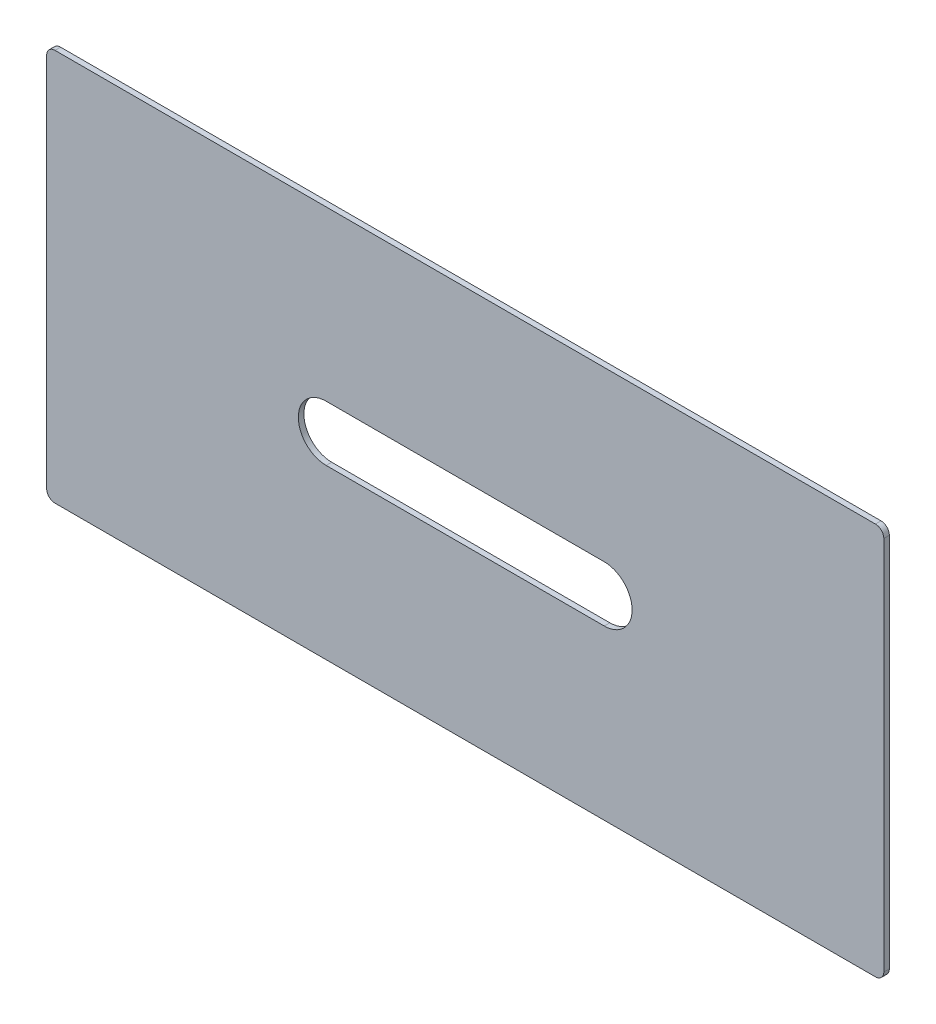
ISO-10303-21;
HEADER;
FILE_DESCRIPTION(('STEP AP214'),'2;1');
FILE_NAME('part.step','',(''),(''),'','','');
FILE_SCHEMA(('AUTOMOTIVE_DESIGN { 1 0 10303 214 1 1 1 1 }'));
ENDSEC;
DATA;
#1=APPLICATION_CONTEXT('core data for automotive mechanical design processes');
#2=APPLICATION_PROTOCOL_DEFINITION('international standard','automotive_design',2000,#1);
#3=PRODUCT_CONTEXT('',#1,'mechanical');
#4=PRODUCT('Part','Part','',(#3));
#5=PRODUCT_RELATED_PRODUCT_CATEGORY('part','',(#4));
#6=PRODUCT_DEFINITION_FORMATION('','',#4);
#7=PRODUCT_DEFINITION_CONTEXT('part definition',#1,'design');
#8=PRODUCT_DEFINITION('design','',#6,#7);
#9=PRODUCT_DEFINITION_SHAPE('','',#8);
#10=(LENGTH_UNIT() NAMED_UNIT(*) SI_UNIT(.MILLI.,.METRE.));
#11=(NAMED_UNIT(*) PLANE_ANGLE_UNIT() SI_UNIT($,.RADIAN.));
#12=(NAMED_UNIT(*) SI_UNIT($,.STERADIAN.) SOLID_ANGLE_UNIT());
#13=UNCERTAINTY_MEASURE_WITH_UNIT(LENGTH_MEASURE(1.E-05),#10,'distance_accuracy_value','');
#14=(GEOMETRIC_REPRESENTATION_CONTEXT(3) GLOBAL_UNCERTAINTY_ASSIGNED_CONTEXT((#13)) GLOBAL_UNIT_ASSIGNED_CONTEXT((#10,
#11,#12)) REPRESENTATION_CONTEXT('',''));
#15=CARTESIAN_POINT('',(0.,0.,0.));
#16=DIRECTION('',(0.,0.,1.));
#17=DIRECTION('',(1.,0.,0.));
#18=AXIS2_PLACEMENT_3D('',#15,#16,#17);
#19=CARTESIAN_POINT('',(-5.,-15.,-2.));
#20=DIRECTION('',(-1.,0.,0.));
#21=DIRECTION('',(0.,-1.,0.));
#22=AXIS2_PLACEMENT_3D('',#19,#20,#21);
#23=PLANE('',#22);
#24=DIRECTION('',(0.,-1.,0.));
#25=VECTOR('',#24,1.);
#26=CARTESIAN_POINT('',(-5.,-15.,-2.));
#27=LINE('',#26,#25);
#28=CARTESIAN_POINT('',(-5.,-18.,-2.));
#29=VERTEX_POINT('',#28);
#30=CARTESIAN_POINT('',(-4.99999999999999,-153.,-2.));
#31=VERTEX_POINT('',#30);
#32=EDGE_CURVE('E160',#29,#31,#27,.T.);
#33=ORIENTED_EDGE('',*,*,#32,.T.);
#34=DIRECTION('',(0.,0.,1.));
#35=VECTOR('',#34,1.);
#36=CARTESIAN_POINT('',(-4.99999999999999,-153.,-2.));
#37=LINE('',#36,#35);
#38=CARTESIAN_POINT('',(-4.99999999999999,-153.,0.));
#39=VERTEX_POINT('',#38);
#40=EDGE_CURVE('E185',#31,#39,#37,.T.);
#41=ORIENTED_EDGE('',*,*,#40,.T.);
#42=DIRECTION('',(0.,-1.,0.));
#43=VECTOR('',#42,1.);
#44=CARTESIAN_POINT('',(-5.,-15.,0.));
#45=LINE('',#44,#43);
#46=CARTESIAN_POINT('',(-5.,-18.,0.));
#47=VERTEX_POINT('',#46);
#48=EDGE_CURVE('E156',#47,#39,#45,.T.);
#49=ORIENTED_EDGE('',*,*,#48,.F.);
#50=DIRECTION('',(0.,0.,1.));
#51=VECTOR('',#50,1.);
#52=CARTESIAN_POINT('',(-5.,-18.,-2.));
#53=LINE('',#52,#51);
#54=EDGE_CURVE('E173',#47,#29,#53,.F.);
#55=ORIENTED_EDGE('',*,*,#54,.T.);
#56=EDGE_LOOP('',(#33,#41,#49,#55));
#57=FACE_BOUND('',#56,.T.);
#58=ADVANCED_FACE('F35',(#57),#23,.T.);
#59=CARTESIAN_POINT('',(-5.,-15.,-2.));
#60=DIRECTION('',(0.,1.,0.));
#61=DIRECTION('',(0.,0.,1.));
#62=AXIS2_PLACEMENT_3D('',#59,#60,#61);
#63=PLANE('',#62);
#64=DIRECTION('',(-1.,0.,0.));
#65=VECTOR('',#64,1.);
#66=CARTESIAN_POINT('',(-5.,-15.,0.));
#67=LINE('',#66,#65);
#68=CARTESIAN_POINT('',(293.,-15.,0.));
#69=VERTEX_POINT('',#68);
#70=CARTESIAN_POINT('',(-2.,-15.,0.));
#71=VERTEX_POINT('',#70);
#72=EDGE_CURVE('E164',#69,#71,#67,.T.);
#73=ORIENTED_EDGE('',*,*,#72,.F.);
#74=DIRECTION('',(0.,0.,1.));
#75=VECTOR('',#74,1.);
#76=CARTESIAN_POINT('',(293.,-15.,-2.));
#77=LINE('',#76,#75);
#78=CARTESIAN_POINT('',(293.,-15.,-2.));
#79=VERTEX_POINT('',#78);
#80=EDGE_CURVE('E11',#69,#79,#77,.F.);
#81=ORIENTED_EDGE('',*,*,#80,.T.);
#82=DIRECTION('',(-1.,0.,0.));
#83=VECTOR('',#82,1.);
#84=CARTESIAN_POINT('',(-5.,-15.,-2.));
#85=LINE('',#84,#83);
#86=CARTESIAN_POINT('',(-2.,-15.,-2.));
#87=VERTEX_POINT('',#86);
#88=EDGE_CURVE('E170',#79,#87,#85,.T.);
#89=ORIENTED_EDGE('',*,*,#88,.T.);
#90=DIRECTION('',(0.,0.,1.));
#91=VECTOR('',#90,1.);
#92=CARTESIAN_POINT('',(-2.,-15.,-2.));
#93=LINE('',#92,#91);
#94=EDGE_CURVE('E43',#87,#71,#93,.T.);
#95=ORIENTED_EDGE('',*,*,#94,.T.);
#96=EDGE_LOOP('',(#73,#81,#89,#95));
#97=FACE_BOUND('',#96,.T.);
#98=ADVANCED_FACE('F217',(#97),#63,.T.);
#99=CARTESIAN_POINT('',(296.,-15.,-2.));
#100=DIRECTION('',(1.,0.,0.));
#101=DIRECTION('',(0.,0.,-1.));
#102=AXIS2_PLACEMENT_3D('',#99,#100,#101);
#103=PLANE('',#102);
#104=DIRECTION('',(0.,1.,0.));
#105=VECTOR('',#104,1.);
#106=CARTESIAN_POINT('',(296.,-15.,0.));
#107=LINE('',#106,#105);
#108=CARTESIAN_POINT('',(296.,-153.,0.));
#109=VERTEX_POINT('',#108);
#110=CARTESIAN_POINT('',(296.,-18.,0.));
#111=VERTEX_POINT('',#110);
#112=EDGE_CURVE('E179',#109,#111,#107,.T.);
#113=ORIENTED_EDGE('',*,*,#112,.F.);
#114=DIRECTION('',(0.,0.,1.));
#115=VECTOR('',#114,1.);
#116=CARTESIAN_POINT('',(296.,-153.,-2.));
#117=LINE('',#116,#115);
#118=CARTESIAN_POINT('',(296.,-153.,-2.));
#119=VERTEX_POINT('',#118);
#120=EDGE_CURVE('E212',#109,#119,#117,.F.);
#121=ORIENTED_EDGE('',*,*,#120,.T.);
#122=DIRECTION('',(0.,1.,0.));
#123=VECTOR('',#122,1.);
#124=CARTESIAN_POINT('',(296.,-15.,-2.));
#125=LINE('',#124,#123);
#126=CARTESIAN_POINT('',(296.,-18.,-2.));
#127=VERTEX_POINT('',#126);
#128=EDGE_CURVE('E167',#119,#127,#125,.T.);
#129=ORIENTED_EDGE('',*,*,#128,.T.);
#130=DIRECTION('',(0.,0.,1.));
#131=VECTOR('',#130,1.);
#132=CARTESIAN_POINT('',(296.,-18.,-2.));
#133=LINE('',#132,#131);
#134=EDGE_CURVE('E209',#127,#111,#133,.T.);
#135=ORIENTED_EDGE('',*,*,#134,.T.);
#136=EDGE_LOOP('',(#113,#121,#129,#135));
#137=FACE_BOUND('',#136,.T.);
#138=ADVANCED_FACE('F231',(#137),#103,.T.);
#139=CARTESIAN_POINT('',(-4.99999999999999,-156.,-2.));
#140=DIRECTION('',(0.,-1.,0.));
#141=DIRECTION('',(0.,0.,-1.));
#142=AXIS2_PLACEMENT_3D('',#139,#140,#141);
#143=PLANE('',#142);
#144=DIRECTION('',(1.,0.,0.));
#145=VECTOR('',#144,1.);
#146=CARTESIAN_POINT('',(-4.99999999999999,-156.,0.));
#147=LINE('',#146,#145);
#148=CARTESIAN_POINT('',(-1.99999999999999,-156.,0.));
#149=VERTEX_POINT('',#148);
#150=CARTESIAN_POINT('',(293.,-156.,0.));
#151=VERTEX_POINT('',#150);
#152=EDGE_CURVE('E176',#149,#151,#147,.T.);
#153=ORIENTED_EDGE('',*,*,#152,.F.);
#154=DIRECTION('',(0.,0.,1.));
#155=VECTOR('',#154,1.);
#156=CARTESIAN_POINT('',(-1.99999999999999,-156.,-2.));
#157=LINE('',#156,#155);
#158=CARTESIAN_POINT('',(-1.99999999999999,-156.,-2.));
#159=VERTEX_POINT('',#158);
#160=EDGE_CURVE('E199',#149,#159,#157,.F.);
#161=ORIENTED_EDGE('',*,*,#160,.T.);
#162=DIRECTION('',(1.,0.,0.));
#163=VECTOR('',#162,1.);
#164=CARTESIAN_POINT('',(-4.99999999999999,-156.,-2.));
#165=LINE('',#164,#163);
#166=CARTESIAN_POINT('',(293.,-156.,-2.));
#167=VERTEX_POINT('',#166);
#168=EDGE_CURVE('E163',#159,#167,#165,.T.);
#169=ORIENTED_EDGE('',*,*,#168,.T.);
#170=DIRECTION('',(0.,0.,1.));
#171=VECTOR('',#170,1.);
#172=CARTESIAN_POINT('',(293.,-156.,-2.));
#173=LINE('',#172,#171);
#174=EDGE_CURVE('E196',#167,#151,#173,.T.);
#175=ORIENTED_EDGE('',*,*,#174,.T.);
#176=EDGE_LOOP('',(#153,#161,#169,#175));
#177=FACE_BOUND('',#176,.T.);
#178=ADVANCED_FACE('F241',(#177),#143,.T.);
#179=CARTESIAN_POINT('',(0.,0.,-2.));
#180=DIRECTION('',(0.,0.,1.));
#181=DIRECTION('',(1.,0.,0.));
#182=AXIS2_PLACEMENT_3D('',#179,#180,#181);
#183=PLANE('',#182);
#184=DIRECTION('',(-1.,0.,0.));
#185=VECTOR('',#184,1.);
#186=CARTESIAN_POINT('',(95.5,-75.5,-2.));
#187=LINE('',#186,#185);
#188=CARTESIAN_POINT('',(195.5,-75.5,-2.));
#189=VERTEX_POINT('',#188);
#190=CARTESIAN_POINT('',(95.5,-75.5,-2.));
#191=VERTEX_POINT('',#190);
#192=EDGE_CURVE('E131',#189,#191,#187,.T.);
#193=ORIENTED_EDGE('',*,*,#192,.T.);
#194=CARTESIAN_POINT('',(95.5,-85.5,-2.));
#195=DIRECTION('',(0.,0.,1.));
#196=DIRECTION('',(1.,0.,0.));
#197=AXIS2_PLACEMENT_3D('',#194,#195,#196);
#198=CIRCLE('',#197,9.99999999999999);
#199=CARTESIAN_POINT('',(95.5,-95.5,-2.));
#200=VERTEX_POINT('',#199);
#201=EDGE_CURVE('E125',#191,#200,#198,.T.);
#202=ORIENTED_EDGE('',*,*,#201,.T.);
#203=DIRECTION('',(1.,0.,0.));
#204=VECTOR('',#203,1.);
#205=CARTESIAN_POINT('',(95.5,-95.5,-2.));
#206=LINE('',#205,#204);
#207=CARTESIAN_POINT('',(195.5,-95.5,-2.));
#208=VERTEX_POINT('',#207);
#209=EDGE_CURVE('E134',#200,#208,#206,.T.);
#210=ORIENTED_EDGE('',*,*,#209,.T.);
#211=CARTESIAN_POINT('',(195.5,-85.5,-2.));
#212=DIRECTION('',(0.,0.,1.));
#213=DIRECTION('',(1.,0.,0.));
#214=AXIS2_PLACEMENT_3D('',#211,#212,#213);
#215=CIRCLE('',#214,9.99999999999998);
#216=EDGE_CURVE('E50',#208,#189,#215,.T.);
#217=ORIENTED_EDGE('',*,*,#216,.T.);
#218=EDGE_LOOP('',(#193,#202,#210,#217));
#219=FACE_BOUND('',#218,.T.);
#220=ORIENTED_EDGE('',*,*,#168,.F.);
#221=CARTESIAN_POINT('',(-1.99999999999999,-153.,-2.));
#222=DIRECTION('',(0.,0.,1.));
#223=DIRECTION('',(1.,0.,0.));
#224=AXIS2_PLACEMENT_3D('',#221,#222,#223);
#225=CIRCLE('',#224,3.);
#226=EDGE_CURVE('E207',#159,#31,#225,.F.);
#227=ORIENTED_EDGE('',*,*,#226,.T.);
#228=ORIENTED_EDGE('',*,*,#32,.F.);
#229=CARTESIAN_POINT('',(-2.,-18.,-2.));
#230=DIRECTION('',(0.,0.,1.));
#231=DIRECTION('',(1.,0.,0.));
#232=AXIS2_PLACEMENT_3D('',#229,#230,#231);
#233=CIRCLE('',#232,3.);
#234=EDGE_CURVE('E201',#29,#87,#233,.F.);
#235=ORIENTED_EDGE('',*,*,#234,.T.);
#236=ORIENTED_EDGE('',*,*,#88,.F.);
#237=CARTESIAN_POINT('',(293.,-18.,-2.));
#238=DIRECTION('',(0.,0.,1.));
#239=DIRECTION('',(1.,0.,0.));
#240=AXIS2_PLACEMENT_3D('',#237,#238,#239);
#241=CIRCLE('',#240,3.);
#242=EDGE_CURVE('E203',#79,#127,#241,.F.);
#243=ORIENTED_EDGE('',*,*,#242,.T.);
#244=ORIENTED_EDGE('',*,*,#128,.F.);
#245=CARTESIAN_POINT('',(293.,-153.,-2.));
#246=DIRECTION('',(0.,0.,1.));
#247=DIRECTION('',(1.,0.,0.));
#248=AXIS2_PLACEMENT_3D('',#245,#246,#247);
#249=CIRCLE('',#248,3.);
#250=EDGE_CURVE('E205',#119,#167,#249,.F.);
#251=ORIENTED_EDGE('',*,*,#250,.T.);
#252=EDGE_LOOP('',(#220,#227,#228,#235,#236,#243,#244,#251));
#253=FACE_BOUND('',#252,.T.);
#254=ADVANCED_FACE('F138',(#219,#253),#183,.F.);
#255=CARTESIAN_POINT('',(0.,0.,0.));
#256=DIRECTION('',(0.,0.,1.));
#257=DIRECTION('',(1.,0.,0.));
#258=AXIS2_PLACEMENT_3D('',#255,#256,#257);
#259=PLANE('',#258);
#260=CARTESIAN_POINT('',(95.5,-85.5,0.));
#261=DIRECTION('',(0.,0.,1.));
#262=DIRECTION('',(1.,0.,0.));
#263=AXIS2_PLACEMENT_3D('',#260,#261,#262);
#264=CIRCLE('',#263,9.99999999999999);
#265=CARTESIAN_POINT('',(95.5,-75.5,0.));
#266=VERTEX_POINT('',#265);
#267=CARTESIAN_POINT('',(95.5,-95.5,0.));
#268=VERTEX_POINT('',#267);
#269=EDGE_CURVE('E58',#266,#268,#264,.T.);
#270=ORIENTED_EDGE('',*,*,#269,.F.);
#271=DIRECTION('',(-1.,0.,0.));
#272=VECTOR('',#271,1.);
#273=CARTESIAN_POINT('',(95.5,-75.5,0.));
#274=LINE('',#273,#272);
#275=CARTESIAN_POINT('',(195.5,-75.5,0.));
#276=VERTEX_POINT('',#275);
#277=EDGE_CURVE('E141',#276,#266,#274,.T.);
#278=ORIENTED_EDGE('',*,*,#277,.F.);
#279=CARTESIAN_POINT('',(195.5,-85.5,0.));
#280=DIRECTION('',(0.,0.,1.));
#281=DIRECTION('',(1.,0.,0.));
#282=AXIS2_PLACEMENT_3D('',#279,#280,#281);
#283=CIRCLE('',#282,9.99999999999998);
#284=CARTESIAN_POINT('',(195.5,-95.5,0.));
#285=VERTEX_POINT('',#284);
#286=EDGE_CURVE('E144',#285,#276,#283,.T.);
#287=ORIENTED_EDGE('',*,*,#286,.F.);
#288=DIRECTION('',(1.,0.,0.));
#289=VECTOR('',#288,1.);
#290=CARTESIAN_POINT('',(95.5,-95.5,0.));
#291=LINE('',#290,#289);
#292=EDGE_CURVE('E150',#268,#285,#291,.T.);
#293=ORIENTED_EDGE('',*,*,#292,.F.);
#294=EDGE_LOOP('',(#270,#278,#287,#293));
#295=FACE_BOUND('',#294,.T.);
#296=ORIENTED_EDGE('',*,*,#48,.T.);
#297=CARTESIAN_POINT('',(-1.99999999999999,-153.,0.));
#298=DIRECTION('',(0.,0.,1.));
#299=DIRECTION('',(1.,0.,0.));
#300=AXIS2_PLACEMENT_3D('',#297,#298,#299);
#301=CIRCLE('',#300,3.);
#302=EDGE_CURVE('E194',#39,#149,#301,.T.);
#303=ORIENTED_EDGE('',*,*,#302,.T.);
#304=ORIENTED_EDGE('',*,*,#152,.T.);
#305=CARTESIAN_POINT('',(293.,-153.,0.));
#306=DIRECTION('',(0.,0.,1.));
#307=DIRECTION('',(1.,0.,0.));
#308=AXIS2_PLACEMENT_3D('',#305,#306,#307);
#309=CIRCLE('',#308,3.);
#310=EDGE_CURVE('E192',#151,#109,#309,.T.);
#311=ORIENTED_EDGE('',*,*,#310,.T.);
#312=ORIENTED_EDGE('',*,*,#112,.T.);
#313=CARTESIAN_POINT('',(293.,-18.,0.));
#314=DIRECTION('',(0.,0.,1.));
#315=DIRECTION('',(1.,0.,0.));
#316=AXIS2_PLACEMENT_3D('',#313,#314,#315);
#317=CIRCLE('',#316,3.);
#318=EDGE_CURVE('E190',#111,#69,#317,.T.);
#319=ORIENTED_EDGE('',*,*,#318,.T.);
#320=ORIENTED_EDGE('',*,*,#72,.T.);
#321=CARTESIAN_POINT('',(-2.,-18.,0.));
#322=DIRECTION('',(0.,0.,1.));
#323=DIRECTION('',(1.,0.,0.));
#324=AXIS2_PLACEMENT_3D('',#321,#322,#323);
#325=CIRCLE('',#324,3.);
#326=EDGE_CURVE('E188',#71,#47,#325,.T.);
#327=ORIENTED_EDGE('',*,*,#326,.T.);
#328=EDGE_LOOP('',(#296,#303,#304,#311,#312,#319,#320,#327));
#329=FACE_BOUND('',#328,.T.);
#330=ADVANCED_FACE('F223',(#295,#329),#259,.T.);
#331=CARTESIAN_POINT('',(-1.99999999999999,-153.,-2.));
#332=DIRECTION('',(0.,0.,1.));
#333=DIRECTION('',(1.,0.,0.));
#334=AXIS2_PLACEMENT_3D('',#331,#332,#333);
#335=CYLINDRICAL_SURFACE('',#334,3.);
#336=ORIENTED_EDGE('',*,*,#226,.F.);
#337=ORIENTED_EDGE('',*,*,#160,.F.);
#338=ORIENTED_EDGE('',*,*,#302,.F.);
#339=ORIENTED_EDGE('',*,*,#40,.F.);
#340=EDGE_LOOP('',(#336,#337,#338,#339));
#341=FACE_BOUND('',#340,.T.);
#342=ADVANCED_FACE('F246',(#341),#335,.T.);
#343=CARTESIAN_POINT('',(293.,-153.,-2.));
#344=DIRECTION('',(0.,0.,1.));
#345=DIRECTION('',(1.,0.,0.));
#346=AXIS2_PLACEMENT_3D('',#343,#344,#345);
#347=CYLINDRICAL_SURFACE('',#346,3.);
#348=ORIENTED_EDGE('',*,*,#250,.F.);
#349=ORIENTED_EDGE('',*,*,#120,.F.);
#350=ORIENTED_EDGE('',*,*,#310,.F.);
#351=ORIENTED_EDGE('',*,*,#174,.F.);
#352=EDGE_LOOP('',(#348,#349,#350,#351));
#353=FACE_BOUND('',#352,.T.);
#354=ADVANCED_FACE('F238',(#353),#347,.T.);
#355=CARTESIAN_POINT('',(293.,-18.,-2.));
#356=DIRECTION('',(0.,0.,1.));
#357=DIRECTION('',(1.,0.,0.));
#358=AXIS2_PLACEMENT_3D('',#355,#356,#357);
#359=CYLINDRICAL_SURFACE('',#358,3.);
#360=ORIENTED_EDGE('',*,*,#242,.F.);
#361=ORIENTED_EDGE('',*,*,#80,.F.);
#362=ORIENTED_EDGE('',*,*,#318,.F.);
#363=ORIENTED_EDGE('',*,*,#134,.F.);
#364=EDGE_LOOP('',(#360,#361,#362,#363));
#365=FACE_BOUND('',#364,.T.);
#366=ADVANCED_FACE('F229',(#365),#359,.T.);
#367=CARTESIAN_POINT('',(-2.,-18.,-2.));
#368=DIRECTION('',(0.,0.,1.));
#369=DIRECTION('',(1.,0.,0.));
#370=AXIS2_PLACEMENT_3D('',#367,#368,#369);
#371=CYLINDRICAL_SURFACE('',#370,3.);
#372=ORIENTED_EDGE('',*,*,#234,.F.);
#373=ORIENTED_EDGE('',*,*,#54,.F.);
#374=ORIENTED_EDGE('',*,*,#326,.F.);
#375=ORIENTED_EDGE('',*,*,#94,.F.);
#376=EDGE_LOOP('',(#372,#373,#374,#375));
#377=FACE_BOUND('',#376,.T.);
#378=ADVANCED_FACE('F37',(#377),#371,.T.);
#379=CARTESIAN_POINT('',(95.5,-85.5,-2.));
#380=DIRECTION('',(0.,0.,1.));
#381=DIRECTION('',(1.,0.,0.));
#382=AXIS2_PLACEMENT_3D('',#379,#380,#381);
#383=CYLINDRICAL_SURFACE('',#382,9.99999999999999);
#384=ORIENTED_EDGE('',*,*,#269,.T.);
#385=DIRECTION('',(0.,0.,1.));
#386=VECTOR('',#385,1.);
#387=CARTESIAN_POINT('',(95.5,-95.5,-2.));
#388=LINE('',#387,#386);
#389=EDGE_CURVE('E121',#200,#268,#388,.T.);
#390=ORIENTED_EDGE('',*,*,#389,.F.);
#391=ORIENTED_EDGE('',*,*,#201,.F.);
#392=DIRECTION('',(0.,0.,1.));
#393=VECTOR('',#392,1.);
#394=CARTESIAN_POINT('',(95.5,-75.5,-2.));
#395=LINE('',#394,#393);
#396=EDGE_CURVE('E154',#191,#266,#395,.T.);
#397=ORIENTED_EDGE('',*,*,#396,.T.);
#398=EDGE_LOOP('',(#384,#390,#391,#397));
#399=FACE_BOUND('',#398,.T.);
#400=ADVANCED_FACE('F123',(#399),#383,.F.);
#401=CARTESIAN_POINT('',(95.5,-75.5,-2.));
#402=DIRECTION('',(0.,1.,0.));
#403=DIRECTION('',(-1.,0.,0.));
#404=AXIS2_PLACEMENT_3D('',#401,#402,#403);
#405=PLANE('',#404);
#406=ORIENTED_EDGE('',*,*,#277,.T.);
#407=ORIENTED_EDGE('',*,*,#396,.F.);
#408=ORIENTED_EDGE('',*,*,#192,.F.);
#409=DIRECTION('',(0.,0.,1.));
#410=VECTOR('',#409,1.);
#411=CARTESIAN_POINT('',(195.5,-75.5,-2.));
#412=LINE('',#411,#410);
#413=EDGE_CURVE('E157',#189,#276,#412,.T.);
#414=ORIENTED_EDGE('',*,*,#413,.T.);
#415=EDGE_LOOP('',(#406,#407,#408,#414));
#416=FACE_BOUND('',#415,.T.);
#417=ADVANCED_FACE('F255',(#416),#405,.F.);
#418=CARTESIAN_POINT('',(195.5,-85.5,-2.));
#419=DIRECTION('',(0.,0.,1.));
#420=DIRECTION('',(1.,0.,0.));
#421=AXIS2_PLACEMENT_3D('',#418,#419,#420);
#422=CYLINDRICAL_SURFACE('',#421,9.99999999999998);
#423=ORIENTED_EDGE('',*,*,#286,.T.);
#424=ORIENTED_EDGE('',*,*,#413,.F.);
#425=ORIENTED_EDGE('',*,*,#216,.F.);
#426=DIRECTION('',(0.,0.,1.));
#427=VECTOR('',#426,1.);
#428=CARTESIAN_POINT('',(195.5,-95.5,-2.));
#429=LINE('',#428,#427);
#430=EDGE_CURVE('E130',#208,#285,#429,.T.);
#431=ORIENTED_EDGE('',*,*,#430,.T.);
#432=EDGE_LOOP('',(#423,#424,#425,#431));
#433=FACE_BOUND('',#432,.T.);
#434=ADVANCED_FACE('F300',(#433),#422,.F.);
#435=CARTESIAN_POINT('',(95.5,-95.5,-2.));
#436=DIRECTION('',(0.,-1.,0.));
#437=DIRECTION('',(1.,0.,0.));
#438=AXIS2_PLACEMENT_3D('',#435,#436,#437);
#439=PLANE('',#438);
#440=ORIENTED_EDGE('',*,*,#292,.T.);
#441=ORIENTED_EDGE('',*,*,#430,.F.);
#442=ORIENTED_EDGE('',*,*,#209,.F.);
#443=ORIENTED_EDGE('',*,*,#389,.T.);
#444=EDGE_LOOP('',(#440,#441,#442,#443));
#445=FACE_BOUND('',#444,.T.);
#446=ADVANCED_FACE('F135',(#445),#439,.F.);
#447=CLOSED_SHELL('',(#58,#98,#138,#178,#254,#330,#342,#354,#366,#378,#400,#417,#434,#446));
#448=MANIFOLD_SOLID_BREP('B2',#447);
#449=ADVANCED_BREP_SHAPE_REPRESENTATION('',(#18,#448),#14);
#450=SHAPE_DEFINITION_REPRESENTATION(#9,#449);
ENDSEC;
END-ISO-10303-21;
